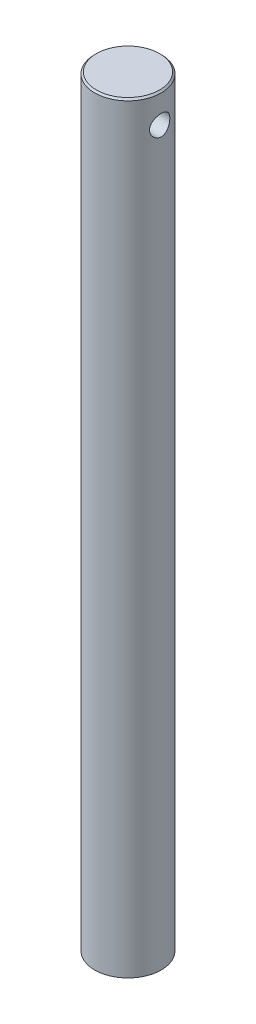
ISO-10303-21;
HEADER;
FILE_DESCRIPTION(('STEP AP214'),'2;1');
FILE_NAME('part.step','',(''),(''),'','','');
FILE_SCHEMA(('AUTOMOTIVE_DESIGN { 1 0 10303 214 1 1 1 1 }'));
ENDSEC;
DATA;
#1=APPLICATION_CONTEXT('core data for automotive mechanical design processes');
#2=APPLICATION_PROTOCOL_DEFINITION('international standard','automotive_design',2000,#1);
#3=PRODUCT_CONTEXT('',#1,'mechanical');
#4=PRODUCT('Part','Part','',(#3));
#5=PRODUCT_RELATED_PRODUCT_CATEGORY('part','',(#4));
#6=PRODUCT_DEFINITION_FORMATION('','',#4);
#7=PRODUCT_DEFINITION_CONTEXT('part definition',#1,'design');
#8=PRODUCT_DEFINITION('design','',#6,#7);
#9=PRODUCT_DEFINITION_SHAPE('','',#8);
#10=(LENGTH_UNIT() NAMED_UNIT(*) SI_UNIT(.MILLI.,.METRE.));
#11=(NAMED_UNIT(*) PLANE_ANGLE_UNIT() SI_UNIT($,.RADIAN.));
#12=(NAMED_UNIT(*) SI_UNIT($,.STERADIAN.) SOLID_ANGLE_UNIT());
#13=UNCERTAINTY_MEASURE_WITH_UNIT(LENGTH_MEASURE(1.E-05),#10,'distance_accuracy_value','');
#14=(GEOMETRIC_REPRESENTATION_CONTEXT(3) GLOBAL_UNCERTAINTY_ASSIGNED_CONTEXT((#13)) GLOBAL_UNIT_ASSIGNED_CONTEXT((#10,
#11,#12)) REPRESENTATION_CONTEXT('',''));
#15=CARTESIAN_POINT('',(0.,0.,0.));
#16=DIRECTION('',(0.,0.,1.));
#17=DIRECTION('',(1.,0.,0.));
#18=AXIS2_PLACEMENT_3D('',#15,#16,#17);
#19=CARTESIAN_POINT('',(0.,203.2,0.));
#20=DIRECTION('',(0.,-1.,0.));
#21=DIRECTION('',(0.,0.,-1.));
#22=AXIS2_PLACEMENT_3D('',#19,#20,#21);
#23=CYLINDRICAL_SURFACE('',#22,10.00125);
#24=CARTESIAN_POINT('',(0.,228.4095,0.));
#25=DIRECTION('',(0.,1.,0.));
#26=DIRECTION('',(0.,0.,1.));
#27=AXIS2_PLACEMENT_3D('',#24,#25,#26);
#28=CIRCLE('',#27,10.00125);
#29=CARTESIAN_POINT('',(0.,228.4095,10.00125));
#30=VERTEX_POINT('',#29);
#31=EDGE_CURVE('E10',#30,#30,#28,.F.);
#32=ORIENTED_EDGE('',*,*,#31,.T.);
#33=EDGE_LOOP('',(#32));
#34=FACE_BOUND('',#33,.T.);
#35=CARTESIAN_POINT('',(-9.52547623809435,220.0275,-3.04799999999999));
#36=CARTESIAN_POINT('',(-9.52547771803146,220.194383307536,-3.04799826734973));
#37=CARTESIAN_POINT('',(-9.5299098404311,220.361283768594,-3.03424768981383));
#38=CARTESIAN_POINT('',(-9.54708579866541,220.690196230751,-2.97975626941195));
#39=CARTESIAN_POINT('',(-9.55983220940409,220.85220670117,-2.93900706511057));
#40=CARTESIAN_POINT('',(-9.59206191014189,221.166529042035,-2.83203772636569));
#41=CARTESIAN_POINT('',(-9.611533721238,221.31885691755,-2.76586097012247));
#42=CARTESIAN_POINT('',(-9.65500454762855,221.610287585268,-2.61005842858471));
#43=CARTESIAN_POINT('',(-9.67900428710517,221.749388256595,-2.52042889144001));
#44=CARTESIAN_POINT('',(-9.7297060177692,222.014959578883,-2.31713023525957));
#45=CARTESIAN_POINT('',(-9.75646697235288,222.140934435844,-2.20282801071262));
#46=CARTESIAN_POINT('',(-9.80917290213797,222.372257288852,-1.95478459114269));
#47=CARTESIAN_POINT('',(-9.8351177687222,222.477602548873,-1.82104082175333));
#48=CARTESIAN_POINT('',(-9.88393977291743,222.666841898967,-1.53437032170822));
#49=CARTESIAN_POINT('',(-9.90673935867303,222.750228561199,-1.3810942581619));
#50=CARTESIAN_POINT('',(-9.94601553314381,222.889848566823,-1.06188128042396));
#51=CARTESIAN_POINT('',(-9.96249353131947,222.946087963689,-0.8959471983655));
#52=CARTESIAN_POINT('',(-9.98685264518631,223.028170741156,-0.561316997639507));
#53=CARTESIAN_POINT('',(-9.99497273557231,223.05486082008,-0.392846280527118));
#54=CARTESIAN_POINT('',(-10.0025436187776,223.079766642822,-0.0536354304494399));
#55=CARTESIAN_POINT('',(-10.0019962888204,223.077988552385,0.117104203101184));
#56=CARTESIAN_POINT('',(-9.99246197175773,223.046572570789,0.450058988652248));
#57=CARTESIAN_POINT('',(-9.98375286289696,223.017851940975,0.612369906628832));
#58=CARTESIAN_POINT('',(-9.9592127972787,222.934867030701,0.929747771116726));
#59=CARTESIAN_POINT('',(-9.94338138416033,222.88060111342,1.08481425273866));
#60=CARTESIAN_POINT('',(-9.90599559129025,222.747456957062,1.38545772863194));
#61=CARTESIAN_POINT('',(-9.88437547556415,222.668294063142,1.53090014818815));
#62=CARTESIAN_POINT('',(-9.83769975463691,222.487829452863,1.80672698519148));
#63=CARTESIAN_POINT('',(-9.8126433143703,222.386522351648,1.93710772824975));
#64=CARTESIAN_POINT('',(-9.76059608178533,222.159905801203,2.18458263728279));
#65=CARTESIAN_POINT('',(-9.73356798847833,222.033802675576,2.30094316417639));
#66=CARTESIAN_POINT('',(-9.6814897879969,221.763613416452,2.51107697237742));
#67=CARTESIAN_POINT('',(-9.65643989089424,221.619525377253,2.60484785697176));
#68=CARTESIAN_POINT('',(-9.61097229857708,221.31547178465,2.76793867848922));
#69=CARTESIAN_POINT('',(-9.59060432545388,221.155359605121,2.83700013933809));
#70=CARTESIAN_POINT('',(-9.55739403877662,220.825010787467,2.94695740431098));
#71=CARTESIAN_POINT('',(-9.54454917744002,220.654777598471,2.9878627446307));
#72=CARTESIAN_POINT('',(-9.52840103287201,220.316018965436,3.03895874248387));
#73=CARTESIAN_POINT('',(-9.52475054644815,220.147678627223,3.05026771139726));
#74=CARTESIAN_POINT('',(-9.52644291497105,219.811498317781,3.04497912073771));
#75=CARTESIAN_POINT('',(-9.53178446247233,219.643658277364,3.02838561819615));
#76=CARTESIAN_POINT('',(-9.5505175053092,219.317963646755,2.96876038542952));
#77=CARTESIAN_POINT('',(-9.56368717086285,219.159961740699,2.92645650893234));
#78=CARTESIAN_POINT('',(-9.59636077070098,218.853311820803,2.81745932904596));
#79=CARTESIAN_POINT('',(-9.61586570404046,218.704665286698,2.75076217869274));
#80=CARTESIAN_POINT('',(-9.65967955693084,218.416417299327,2.59277267181097));
#81=CARTESIAN_POINT('',(-9.68410598620832,218.277177695693,2.50085354148289));
#82=CARTESIAN_POINT('',(-9.7347616329919,218.015691342169,2.29576887747081));
#83=CARTESIAN_POINT('',(-9.76099129489299,217.893448803692,2.18259809447054));
#84=CARTESIAN_POINT('',(-9.81353992134606,217.664496375744,1.93295234619792));
#85=CARTESIAN_POINT('',(-9.83982222729056,217.558581340017,1.79573883457735));
#86=CARTESIAN_POINT('',(-9.88848434936863,217.371256211164,1.50485594122455));
#87=CARTESIAN_POINT('',(-9.91086435427547,217.289844932534,1.35118735608505));
#88=CARTESIAN_POINT('',(-9.94906658279241,217.154623314733,1.03274874024921));
#89=CARTESIAN_POINT('',(-9.96493715027915,217.10060876974,0.868071518818044));
#90=CARTESIAN_POINT('',(-9.98854555449202,217.021206437734,0.531404893913147));
#91=CARTESIAN_POINT('',(-9.99628579972163,216.995810172759,0.359417671650448));
#92=CARTESIAN_POINT('',(-10.002609923348,216.975026715854,0.0203477231196271));
#93=CARTESIAN_POINT('',(-10.0015449905355,216.978488582629,-0.146658766847028));
#94=CARTESIAN_POINT('',(-9.99121121055165,217.012559713607,-0.477605387852913));
#95=CARTESIAN_POINT('',(-9.98194285437029,217.043167353086,-0.641545701808806));
#96=CARTESIAN_POINT('',(-9.95634793874126,217.129940934029,-0.95988153430514));
#97=CARTESIAN_POINT('',(-9.9401029746803,217.185811795467,-1.11436449978268));
#98=CARTESIAN_POINT('',(-9.9022327300976,217.321261027445,-1.41184215086542));
#99=CARTESIAN_POINT('',(-9.88060655007505,217.400843361931,-1.55483491052561));
#100=CARTESIAN_POINT('',(-9.83335961568474,217.58447431759,-1.83036311103152));
#101=CARTESIAN_POINT('',(-9.80763126932702,217.68923859207,-1.96240297423655));
#102=CARTESIAN_POINT('',(-9.75541163622315,217.918980835181,-2.20741219483597));
#103=CARTESIAN_POINT('',(-9.72892012841637,218.043964710097,-2.32037596020455));
#104=CARTESIAN_POINT('',(-9.67720216546879,218.315252973426,-2.52755513397213));
#105=CARTESIAN_POINT('',(-9.65204052003493,218.462098816625,-2.62107959203014));
#106=CARTESIAN_POINT('',(-9.60689559337832,218.770166700109,-2.78201082568284));
#107=CARTESIAN_POINT('',(-9.58690997120318,218.931382196952,-2.84942941499531));
#108=CARTESIAN_POINT('',(-9.55622934582484,219.247115387383,-2.95059239699538));
#109=CARTESIAN_POINT('',(-9.54480851769076,219.4007069165,-2.9870171321726));
#110=CARTESIAN_POINT('',(-9.5294320740847,219.712027791798,-3.03571913342529));
#111=CARTESIAN_POINT('',(-9.52547483920756,219.869756232844,-3.04800163775984));
#112=CARTESIAN_POINT('',(-9.52547623809435,220.0275,-3.04799999999999));
#113=B_SPLINE_CURVE_WITH_KNOTS('',3,(#35,#36,#37,#38,#39,#40,#41,#42,#43,#44,#45,#46,#47,#48,
#49,#50,#51,#52,#53,#54,#55,#56,#57,#58,#59,#60,#61,#62,#63,#64,#65,#66,#67,#68,#69,#70,#71,#72,
#73,#74,#75,#76,#77,#78,#79,#80,#81,#82,#83,#84,#85,#86,#87,#88,#89,#90,#91,#92,#93,#94,#95,#96,
#97,#98,#99,#100,#101,#102,#103,#104,#105,#106,#107,#108,#109,#110,#111,#112),.UNSPECIFIED.,.T.,
.F.,(4,2,2,2,2,2,2,2,2,2,2,2,2,2,2,2,2,2,2,2,2,2,2,2,2,2,2,2,2,2,2,2,2,2,2,2,2,2,4),(0.,
0.500067727698103,1.0002903980793,1.49966347408623,1.99911648601351,2.51335500548947,
3.02766168036805,3.55297707149995,4.07817527020385,4.58790032743411,5.09751498794572,
5.59038610887434,6.08328881496508,6.58204549864871,7.08092360128993,7.59962130612586,
8.11837401947339,8.6424046386956,9.16625768655479,9.67001026175592,10.1736895974486,
10.6637341228075,11.1538559644441,11.6574759579589,12.1612205133798,12.68467435907,
13.2081028757223,13.7275703888477,14.2468839729618,14.7455880819971,15.2442623446878,
15.7372567042199,16.2303335259833,16.7395519413696,17.2489193724471,17.7741007881096,
18.2990442643195,18.7718278489149,19.2445088399917),.UNSPECIFIED.);
#114=CARTESIAN_POINT('',(-9.52547623809435,220.0275,-3.04799999999999));
#115=VERTEX_POINT('',#114);
#116=EDGE_CURVE('E57',#115,#115,#113,.T.);
#117=ORIENTED_EDGE('',*,*,#116,.T.);
#118=EDGE_LOOP('',(#117));
#119=FACE_BOUND('',#118,.T.);
#120=CARTESIAN_POINT('',(9.52547623809435,220.0275,-3.048));
#121=CARTESIAN_POINT('',(9.52547771803146,219.860616692464,-3.04799826734973));
#122=CARTESIAN_POINT('',(9.5299098404311,219.693716231406,-3.03424768981384));
#123=CARTESIAN_POINT('',(9.5470857986654,219.364803769249,-2.97975626941195));
#124=CARTESIAN_POINT('',(9.55983220940409,219.20279329883,-2.93900706511057));
#125=CARTESIAN_POINT('',(9.59206191014189,218.888470957965,-2.83203772636569));
#126=CARTESIAN_POINT('',(9.611533721238,218.73614308245,-2.76586097012247));
#127=CARTESIAN_POINT('',(9.65500454762855,218.444712414732,-2.61005842858471));
#128=CARTESIAN_POINT('',(9.67900428710517,218.305611743405,-2.52042889144002));
#129=CARTESIAN_POINT('',(9.7297060177692,218.040040421117,-2.31713023525957));
#130=CARTESIAN_POINT('',(9.75646697235288,217.914065564156,-2.20282801071263));
#131=CARTESIAN_POINT('',(9.80917290213797,217.682742711148,-1.9547845911427));
#132=CARTESIAN_POINT('',(9.8351177687222,217.577397451127,-1.82104082175333));
#133=CARTESIAN_POINT('',(9.88393977291743,217.388158101033,-1.53437032170822));
#134=CARTESIAN_POINT('',(9.90673935867303,217.3047714388,-1.38109425816191));
#135=CARTESIAN_POINT('',(9.94601553314381,217.165151433177,-1.06188128042396));
#136=CARTESIAN_POINT('',(9.96249353131947,217.108912036311,-0.895947198365504));
#137=CARTESIAN_POINT('',(9.98685264518631,217.026829258844,-0.561316997639511));
#138=CARTESIAN_POINT('',(9.99497273557231,217.00013917992,-0.392846280527121));
#139=CARTESIAN_POINT('',(10.0025436187776,216.975233357178,-0.0536354304494426));
#140=CARTESIAN_POINT('',(10.0019962888204,216.977011447615,0.117104203101182));
#141=CARTESIAN_POINT('',(9.99246197175773,217.008427429211,0.450058988652245));
#142=CARTESIAN_POINT('',(9.98375286289696,217.037148059025,0.612369906628829));
#143=CARTESIAN_POINT('',(9.9592127972787,217.120132969299,0.929747771116723));
#144=CARTESIAN_POINT('',(9.94338138416033,217.17439888658,1.08481425273866));
#145=CARTESIAN_POINT('',(9.90599559129025,217.307543042938,1.38545772863193));
#146=CARTESIAN_POINT('',(9.88437547556415,217.386705936858,1.53090014818815));
#147=CARTESIAN_POINT('',(9.83769975463691,217.567170547137,1.80672698519148));
#148=CARTESIAN_POINT('',(9.8126433143703,217.668477648352,1.93710772824974));
#149=CARTESIAN_POINT('',(9.76059608178533,217.895094198797,2.18458263728279));
#150=CARTESIAN_POINT('',(9.73356798847834,218.021197324424,2.30094316417639));
#151=CARTESIAN_POINT('',(9.6814897879969,218.291386583548,2.51107697237741));
#152=CARTESIAN_POINT('',(9.65643989089423,218.435474622747,2.60484785697176));
#153=CARTESIAN_POINT('',(9.61097229857708,218.73952821535,2.76793867848922));
#154=CARTESIAN_POINT('',(9.59060432545388,218.899640394879,2.8370001393381));
#155=CARTESIAN_POINT('',(9.55739403877662,219.229989212533,2.94695740431098));
#156=CARTESIAN_POINT('',(9.54454917744002,219.400222401529,2.9878627446307));
#157=CARTESIAN_POINT('',(9.52840103287201,219.738981034564,3.03895874248386));
#158=CARTESIAN_POINT('',(9.52475054644815,219.907321372777,3.05026771139725));
#159=CARTESIAN_POINT('',(9.52644291497105,220.243501682219,3.0449791207377));
#160=CARTESIAN_POINT('',(9.53178446247233,220.411341722636,3.02838561819615));
#161=CARTESIAN_POINT('',(9.5505175053092,220.737036353245,2.96876038542952));
#162=CARTESIAN_POINT('',(9.56368717086285,220.895038259301,2.92645650893233));
#163=CARTESIAN_POINT('',(9.59636077070098,221.201688179197,2.81745932904595));
#164=CARTESIAN_POINT('',(9.61586570404047,221.350334713302,2.75076217869273));
#165=CARTESIAN_POINT('',(9.65967955693084,221.638582700673,2.59277267181096));
#166=CARTESIAN_POINT('',(9.68410598620832,221.777822304307,2.50085354148288));
#167=CARTESIAN_POINT('',(9.7347616329919,222.039308657831,2.29576887747079));
#168=CARTESIAN_POINT('',(9.76099129489299,222.161551196308,2.18259809447053));
#169=CARTESIAN_POINT('',(9.81353992134606,222.390503624256,1.93295234619791));
#170=CARTESIAN_POINT('',(9.83982222729056,222.496418659983,1.79573883457733));
#171=CARTESIAN_POINT('',(9.88848434936863,222.683743788836,1.50485594122453));
#172=CARTESIAN_POINT('',(9.91086435427547,222.765155067466,1.35118735608504));
#173=CARTESIAN_POINT('',(9.94906658279241,222.900376685267,1.03274874024921));
#174=CARTESIAN_POINT('',(9.96493715027915,222.95439123026,0.868071518818039));
#175=CARTESIAN_POINT('',(9.98854555449202,223.033793562266,0.531404893913142));
#176=CARTESIAN_POINT('',(9.99628579972163,223.05918982724,0.359417671650443));
#177=CARTESIAN_POINT('',(10.002609923348,223.079973284146,0.0203477231196217));
#178=CARTESIAN_POINT('',(10.0015449905355,223.076511417371,-0.146658766847033));
#179=CARTESIAN_POINT('',(9.99121121055165,223.042440286393,-0.477605387852918));
#180=CARTESIAN_POINT('',(9.98194285437029,223.011832646914,-0.641545701808811));
#181=CARTESIAN_POINT('',(9.95634793874126,222.925059065971,-0.959881534305146));
#182=CARTESIAN_POINT('',(9.94010297468029,222.869188204533,-1.11436449978269));
#183=CARTESIAN_POINT('',(9.9022327300976,222.733738972555,-1.41184215086543));
#184=CARTESIAN_POINT('',(9.88060655007505,222.654156638069,-1.55483491052562));
#185=CARTESIAN_POINT('',(9.83335961568474,222.47052568241,-1.83036311103152));
#186=CARTESIAN_POINT('',(9.80763126932702,222.36576140793,-1.96240297423656));
#187=CARTESIAN_POINT('',(9.75541163622315,222.136019164819,-2.20741219483598));
#188=CARTESIAN_POINT('',(9.72892012841637,222.011035289902,-2.32037596020456));
#189=CARTESIAN_POINT('',(9.67720216546879,221.739747026574,-2.52755513397214));
#190=CARTESIAN_POINT('',(9.65204052003493,221.592901183375,-2.62107959203014));
#191=CARTESIAN_POINT('',(9.60689559337832,221.284833299891,-2.78201082568284));
#192=CARTESIAN_POINT('',(9.58690997120317,221.123617803048,-2.84942941499531));
#193=CARTESIAN_POINT('',(9.55622934582483,220.807884612617,-2.95059239699538));
#194=CARTESIAN_POINT('',(9.54480851769075,220.6542930835,-2.9870171321726));
#195=CARTESIAN_POINT('',(9.52943207408469,220.342972208202,-3.03571913342529));
#196=CARTESIAN_POINT('',(9.52547483920756,220.185243767156,-3.04800163775984));
#197=CARTESIAN_POINT('',(9.52547623809435,220.0275,-3.048));
#198=B_SPLINE_CURVE_WITH_KNOTS('',3,(#120,#121,#122,#123,#124,#125,#126,#127,#128,#129,#130,
#131,#132,#133,#134,#135,#136,#137,#138,#139,#140,#141,#142,#143,#144,#145,#146,#147,#148,#149,
#150,#151,#152,#153,#154,#155,#156,#157,#158,#159,#160,#161,#162,#163,#164,#165,#166,#167,#168,
#169,#170,#171,#172,#173,#174,#175,#176,#177,#178,#179,#180,#181,#182,#183,#184,#185,#186,#187,
#188,#189,#190,#191,#192,#193,#194,#195,#196,#197),.UNSPECIFIED.,.T.,.F.,(4,2,2,2,2,2,2,2,2,2,2,
2,2,2,2,2,2,2,2,2,2,2,2,2,2,2,2,2,2,2,2,2,2,2,2,2,2,2,4),(0.,0.500067727698103,1.0002903980793,
1.49966347408623,1.99911648601351,2.51335500548947,3.02766168036805,3.55297707149995,
4.07817527020385,4.58790032743411,5.09751498794572,5.59038610887434,6.08328881496508,
6.58204549864871,7.08092360128993,7.59962130612586,8.11837401947339,8.64240463869563,
9.16625768655479,9.67001026175592,10.1736895974486,10.6637341228075,11.1538559644441,
11.6574759579589,12.1612205133798,12.6846743590701,13.2081028757223,13.7275703888477,
14.2468839729618,14.7455880819971,15.2442623446878,15.7372567042199,16.2303335259833,
16.7395519413696,17.2489193724471,17.7741007881096,18.2990442643195,18.7718278489149,
19.2445088399917),.UNSPECIFIED.);
#199=CARTESIAN_POINT('',(9.52547623809435,220.0275,-3.048));
#200=VERTEX_POINT('',#199);
#201=EDGE_CURVE('E49',#200,#200,#198,.T.);
#202=ORIENTED_EDGE('',*,*,#201,.T.);
#203=EDGE_LOOP('',(#202));
#204=FACE_BOUND('',#203,.T.);
#205=CARTESIAN_POINT('',(0.,0.,0.));
#206=DIRECTION('',(0.,1.,0.));
#207=DIRECTION('',(0.,0.,1.));
#208=AXIS2_PLACEMENT_3D('',#205,#206,#207);
#209=CIRCLE('',#208,10.00125);
#210=CARTESIAN_POINT('',(0.,0.,10.00125));
#211=VERTEX_POINT('',#210);
#212=EDGE_CURVE('E54',#211,#211,#209,.T.);
#213=ORIENTED_EDGE('',*,*,#212,.T.);
#214=EDGE_LOOP('',(#213));
#215=FACE_BOUND('',#214,.T.);
#216=ADVANCED_FACE('F36',(#34,#119,#204,#215),#23,.T.);
#217=CARTESIAN_POINT('',(0.,0.,0.));
#218=DIRECTION('',(0.,1.,0.));
#219=DIRECTION('',(0.,0.,1.));
#220=AXIS2_PLACEMENT_3D('',#217,#218,#219);
#221=PLANE('',#220);
#222=ORIENTED_EDGE('',*,*,#212,.F.);
#223=EDGE_LOOP('',(#222));
#224=FACE_BOUND('',#223,.T.);
#225=ADVANCED_FACE('F78',(#224),#221,.F.);
#226=CARTESIAN_POINT('',(0.,228.9175,0.));
#227=DIRECTION('',(0.,1.,0.));
#228=DIRECTION('',(0.,0.,1.));
#229=AXIS2_PLACEMENT_3D('',#226,#227,#228);
#230=PLANE('',#229);
#231=CARTESIAN_POINT('',(0.,228.9175,0.));
#232=DIRECTION('',(0.,1.,0.));
#233=DIRECTION('',(0.,0.,1.));
#234=AXIS2_PLACEMENT_3D('',#231,#232,#233);
#235=CIRCLE('',#234,9.49325000000001);
#236=CARTESIAN_POINT('',(0.,228.9175,9.49325000000001));
#237=VERTEX_POINT('',#236);
#238=EDGE_CURVE('E44',#237,#237,#235,.T.);
#239=ORIENTED_EDGE('',*,*,#238,.T.);
#240=EDGE_LOOP('',(#239));
#241=FACE_BOUND('',#240,.T.);
#242=ADVANCED_FACE('F74',(#241),#230,.T.);
#243=CARTESIAN_POINT('',(-15.39875,220.0275,0.));
#244=DIRECTION('',(1.,0.,0.));
#245=DIRECTION('',(0.,0.,-1.));
#246=AXIS2_PLACEMENT_3D('',#243,#244,#245);
#247=CYLINDRICAL_SURFACE('',#246,3.048);
#248=ORIENTED_EDGE('',*,*,#201,.F.);
#249=EDGE_LOOP('',(#248));
#250=FACE_BOUND('',#249,.T.);
#251=ORIENTED_EDGE('',*,*,#116,.F.);
#252=EDGE_LOOP('',(#251));
#253=FACE_BOUND('',#252,.T.);
#254=ADVANCED_FACE('F70',(#250,#253),#247,.F.);
#255=CARTESIAN_POINT('',(0.,228.9175,0.));
#256=DIRECTION('',(0.,-1.,0.));
#257=DIRECTION('',(0.,0.,-1.));
#258=AXIS2_PLACEMENT_3D('',#255,#256,#257);
#259=CONICAL_SURFACE('',#258,9.49325000000001,0.785398163397406);
#260=ORIENTED_EDGE('',*,*,#31,.F.);
#261=EDGE_LOOP('',(#260));
#262=FACE_BOUND('',#261,.T.);
#263=ORIENTED_EDGE('',*,*,#238,.F.);
#264=EDGE_LOOP('',(#263));
#265=FACE_BOUND('',#264,.T.);
#266=ADVANCED_FACE('F38',(#262,#265),#259,.T.);
#267=CLOSED_SHELL('',(#216,#225,#242,#254,#266));
#268=MANIFOLD_SOLID_BREP('B2',#267);
#269=ADVANCED_BREP_SHAPE_REPRESENTATION('',(#18,#268),#14);
#270=SHAPE_DEFINITION_REPRESENTATION(#9,#269);
ENDSEC;
END-ISO-10303-21;
